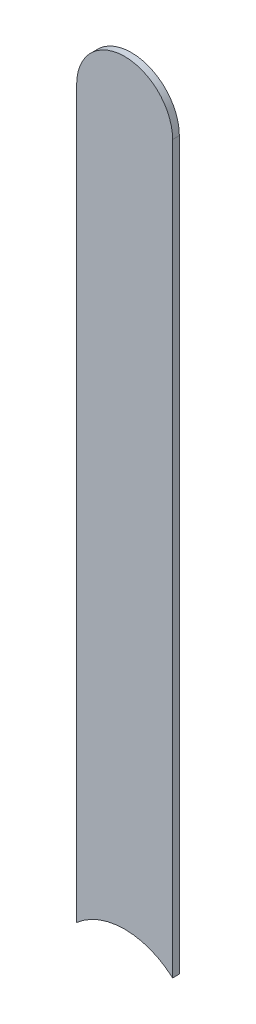
ISO-10303-21;
HEADER;
FILE_DESCRIPTION(('STEP AP214'),'2;1');
FILE_NAME('part.step','',(''),(''),'','','');
FILE_SCHEMA(('AUTOMOTIVE_DESIGN { 1 0 10303 214 1 1 1 1 }'));
ENDSEC;
DATA;
#1=APPLICATION_CONTEXT('core data for automotive mechanical design processes');
#2=APPLICATION_PROTOCOL_DEFINITION('international standard','automotive_design',2000,#1);
#3=PRODUCT_CONTEXT('',#1,'mechanical');
#4=PRODUCT('Part','Part','',(#3));
#5=PRODUCT_RELATED_PRODUCT_CATEGORY('part','',(#4));
#6=PRODUCT_DEFINITION_FORMATION('','',#4);
#7=PRODUCT_DEFINITION_CONTEXT('part definition',#1,'design');
#8=PRODUCT_DEFINITION('design','',#6,#7);
#9=PRODUCT_DEFINITION_SHAPE('','',#8);
#10=(LENGTH_UNIT() NAMED_UNIT(*) SI_UNIT(.MILLI.,.METRE.));
#11=(NAMED_UNIT(*) PLANE_ANGLE_UNIT() SI_UNIT($,.RADIAN.));
#12=(NAMED_UNIT(*) SI_UNIT($,.STERADIAN.) SOLID_ANGLE_UNIT());
#13=UNCERTAINTY_MEASURE_WITH_UNIT(LENGTH_MEASURE(1.E-05),#10,'distance_accuracy_value','');
#14=(GEOMETRIC_REPRESENTATION_CONTEXT(3) GLOBAL_UNCERTAINTY_ASSIGNED_CONTEXT((#13)) GLOBAL_UNIT_ASSIGNED_CONTEXT((#10,
#11,#12)) REPRESENTATION_CONTEXT('',''));
#15=CARTESIAN_POINT('',(0.,0.,0.));
#16=DIRECTION('',(0.,0.,1.));
#17=DIRECTION('',(1.,0.,0.));
#18=AXIS2_PLACEMENT_3D('',#15,#16,#17);
#19=CARTESIAN_POINT('',(176.526,-95.504,-0.035));
#20=DIRECTION('',(-1.,0.,0.));
#21=DIRECTION('',(0.,0.,1.));
#22=AXIS2_PLACEMENT_3D('',#19,#20,#21);
#23=PLANE('',#22);
#24=DIRECTION('',(0.,0.,1.));
#25=VECTOR('',#24,1.);
#26=CARTESIAN_POINT('',(176.526,-91.44,-0.035));
#27=LINE('',#26,#25);
#28=CARTESIAN_POINT('',(176.526,-91.44,-0.035));
#29=VERTEX_POINT('',#28);
#30=CARTESIAN_POINT('',(176.526,-91.44,0.));
#31=VERTEX_POINT('',#30);
#32=EDGE_CURVE('E11',#29,#31,#27,.T.);
#33=ORIENTED_EDGE('',*,*,#32,.T.);
#34=DIRECTION('',(0.,1.,0.));
#35=VECTOR('',#34,1.);
#36=CARTESIAN_POINT('',(176.526,-95.504,0.));
#37=LINE('',#36,#35);
#38=CARTESIAN_POINT('',(176.526,-95.22449150281,0.));
#39=VERTEX_POINT('',#38);
#40=EDGE_CURVE('E26',#39,#31,#37,.T.);
#41=ORIENTED_EDGE('',*,*,#40,.F.);
#42=DIRECTION('',(0.,0.,-1.));
#43=VECTOR('',#42,1.);
#44=CARTESIAN_POINT('',(176.526,-95.22449150281,-0.045));
#45=LINE('',#44,#43);
#46=CARTESIAN_POINT('',(176.526,-95.22449150281,-0.035));
#47=VERTEX_POINT('',#46);
#48=EDGE_CURVE('E57',#39,#47,#45,.T.);
#49=ORIENTED_EDGE('',*,*,#48,.T.);
#50=DIRECTION('',(0.,1.,0.));
#51=VECTOR('',#50,1.);
#52=CARTESIAN_POINT('',(176.526,-95.504,-0.035));
#53=LINE('',#52,#51);
#54=EDGE_CURVE('E73',#47,#29,#53,.T.);
#55=ORIENTED_EDGE('',*,*,#54,.T.);
#56=EDGE_LOOP('',(#33,#41,#49,#55));
#57=FACE_BOUND('',#56,.T.);
#58=ADVANCED_FACE('F17',(#57),#23,.F.);
#59=CARTESIAN_POINT('',(176.276,-91.44,-0.035));
#60=DIRECTION('',(0.,0.,-1.));
#61=DIRECTION('',(1.,0.,0.));
#62=AXIS2_PLACEMENT_3D('',#59,#60,#61);
#63=CYLINDRICAL_SURFACE('',#62,0.25);
#64=CARTESIAN_POINT('',(176.276,-91.44,-0.035));
#65=DIRECTION('',(0.,0.,1.));
#66=DIRECTION('',(1.,0.,0.));
#67=AXIS2_PLACEMENT_3D('',#64,#65,#66);
#68=CIRCLE('',#67,0.25);
#69=CARTESIAN_POINT('',(176.026,-91.44,-0.035));
#70=VERTEX_POINT('',#69);
#71=EDGE_CURVE('E66',#29,#70,#68,.T.);
#72=ORIENTED_EDGE('',*,*,#71,.T.);
#73=DIRECTION('',(0.,0.,1.));
#74=VECTOR('',#73,1.);
#75=CARTESIAN_POINT('',(176.026,-91.44,-0.035));
#76=LINE('',#75,#74);
#77=CARTESIAN_POINT('',(176.026,-91.44,0.));
#78=VERTEX_POINT('',#77);
#79=EDGE_CURVE('E89',#70,#78,#76,.T.);
#80=ORIENTED_EDGE('',*,*,#79,.T.);
#81=CARTESIAN_POINT('',(176.276,-91.44,0.));
#82=DIRECTION('',(0.,0.,1.));
#83=DIRECTION('',(1.,0.,0.));
#84=AXIS2_PLACEMENT_3D('',#81,#82,#83);
#85=CIRCLE('',#84,0.25);
#86=EDGE_CURVE('E68',#31,#78,#85,.T.);
#87=ORIENTED_EDGE('',*,*,#86,.F.);
#88=ORIENTED_EDGE('',*,*,#32,.F.);
#89=EDGE_LOOP('',(#72,#80,#87,#88));
#90=FACE_BOUND('',#89,.T.);
#91=ADVANCED_FACE('F64',(#90),#63,.T.);
#92=CARTESIAN_POINT('',(176.026,-91.44,0.));
#93=DIRECTION('',(0.,0.,1.));
#94=DIRECTION('',(1.,0.,0.));
#95=AXIS2_PLACEMENT_3D('',#92,#93,#94);
#96=PLANE('',#95);
#97=ORIENTED_EDGE('',*,*,#86,.T.);
#98=DIRECTION('',(0.,-1.,0.));
#99=VECTOR('',#98,1.);
#100=CARTESIAN_POINT('',(176.026,-91.44,0.));
#101=LINE('',#100,#99);
#102=CARTESIAN_POINT('',(176.026,-95.22449150279,0.));
#103=VERTEX_POINT('',#102);
#104=EDGE_CURVE('E105',#78,#103,#101,.T.);
#105=ORIENTED_EDGE('',*,*,#104,.T.);
#106=CARTESIAN_POINT('',(176.276,-95.504,0.));
#107=DIRECTION('',(0.,0.,-1.));
#108=DIRECTION('',(0.,-1.,0.));
#109=AXIS2_PLACEMENT_3D('',#106,#107,#108);
#110=CIRCLE('',#109,0.375);
#111=EDGE_CURVE('E78',#103,#39,#110,.T.);
#112=ORIENTED_EDGE('',*,*,#111,.T.);
#113=ORIENTED_EDGE('',*,*,#40,.T.);
#114=EDGE_LOOP('',(#97,#105,#112,#113));
#115=FACE_BOUND('',#114,.T.);
#116=ADVANCED_FACE('F101',(#115),#96,.T.);
#117=CARTESIAN_POINT('',(176.276,-95.504,-0.045));
#118=DIRECTION('',(0.,0.,-1.));
#119=DIRECTION('',(0.,-1.,0.));
#120=AXIS2_PLACEMENT_3D('',#117,#118,#119);
#121=CYLINDRICAL_SURFACE('',#120,0.375);
#122=ORIENTED_EDGE('',*,*,#111,.F.);
#123=DIRECTION('',(0.,0.,-1.));
#124=VECTOR('',#123,1.);
#125=CARTESIAN_POINT('',(176.026,-95.22449150281,-0.045));
#126=LINE('',#125,#124);
#127=CARTESIAN_POINT('',(176.026,-95.22449150279,-0.035));
#128=VERTEX_POINT('',#127);
#129=EDGE_CURVE('E111',#103,#128,#126,.T.);
#130=ORIENTED_EDGE('',*,*,#129,.T.);
#131=CARTESIAN_POINT('',(176.276,-95.504,-0.035));
#132=DIRECTION('',(0.,0.,-1.));
#133=DIRECTION('',(0.,-1.,0.));
#134=AXIS2_PLACEMENT_3D('',#131,#132,#133);
#135=CIRCLE('',#134,0.375);
#136=EDGE_CURVE('E79',#128,#47,#135,.T.);
#137=ORIENTED_EDGE('',*,*,#136,.T.);
#138=ORIENTED_EDGE('',*,*,#48,.F.);
#139=EDGE_LOOP('',(#122,#130,#137,#138));
#140=FACE_BOUND('',#139,.T.);
#141=ADVANCED_FACE('F124',(#140),#121,.F.);
#142=CARTESIAN_POINT('',(176.026,-91.44,-0.035));
#143=DIRECTION('',(0.,0.,1.));
#144=DIRECTION('',(1.,0.,0.));
#145=AXIS2_PLACEMENT_3D('',#142,#143,#144);
#146=PLANE('',#145);
#147=ORIENTED_EDGE('',*,*,#54,.F.);
#148=ORIENTED_EDGE('',*,*,#136,.F.);
#149=DIRECTION('',(0.,-1.,0.));
#150=VECTOR('',#149,1.);
#151=CARTESIAN_POINT('',(176.026,-91.44,-0.035));
#152=LINE('',#151,#150);
#153=EDGE_CURVE('E75',#70,#128,#152,.T.);
#154=ORIENTED_EDGE('',*,*,#153,.F.);
#155=ORIENTED_EDGE('',*,*,#71,.F.);
#156=EDGE_LOOP('',(#147,#148,#154,#155));
#157=FACE_BOUND('',#156,.T.);
#158=ADVANCED_FACE('F71',(#157),#146,.F.);
#159=CARTESIAN_POINT('',(176.026,-91.44,-0.035));
#160=DIRECTION('',(1.,0.,0.));
#161=DIRECTION('',(0.,1.,0.));
#162=AXIS2_PLACEMENT_3D('',#159,#160,#161);
#163=PLANE('',#162);
#164=ORIENTED_EDGE('',*,*,#129,.F.);
#165=ORIENTED_EDGE('',*,*,#104,.F.);
#166=ORIENTED_EDGE('',*,*,#79,.F.);
#167=ORIENTED_EDGE('',*,*,#153,.T.);
#168=EDGE_LOOP('',(#164,#165,#166,#167));
#169=FACE_BOUND('',#168,.T.);
#170=ADVANCED_FACE('F109',(#169),#163,.F.);
#171=CLOSED_SHELL('',(#58,#91,#116,#141,#158,#170));
#172=MANIFOLD_SOLID_BREP('B1',#171);
#173=ADVANCED_BREP_SHAPE_REPRESENTATION('',(#18,#172),#14);
#174=SHAPE_DEFINITION_REPRESENTATION(#9,#173);
ENDSEC;
END-ISO-10303-21;
